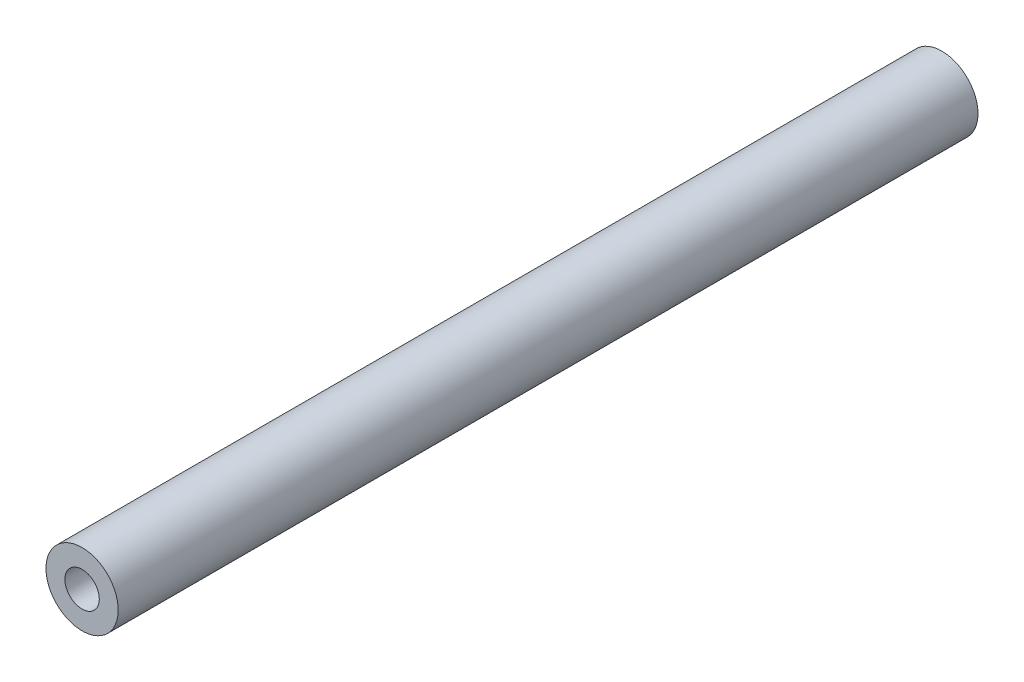
ISO-10303-21;
HEADER;
FILE_DESCRIPTION(('STEP AP214'),'2;1');
FILE_NAME('part.step','',(''),(''),'','','');
FILE_SCHEMA(('AUTOMOTIVE_DESIGN { 1 0 10303 214 1 1 1 1 }'));
ENDSEC;
DATA;
#1=APPLICATION_CONTEXT('core data for automotive mechanical design processes');
#2=APPLICATION_PROTOCOL_DEFINITION('international standard','automotive_design',2000,#1);
#3=PRODUCT_CONTEXT('',#1,'mechanical');
#4=PRODUCT('Part','Part','',(#3));
#5=PRODUCT_RELATED_PRODUCT_CATEGORY('part','',(#4));
#6=PRODUCT_DEFINITION_FORMATION('','',#4);
#7=PRODUCT_DEFINITION_CONTEXT('part definition',#1,'design');
#8=PRODUCT_DEFINITION('design','',#6,#7);
#9=PRODUCT_DEFINITION_SHAPE('','',#8);
#10=(LENGTH_UNIT() NAMED_UNIT(*) SI_UNIT(.MILLI.,.METRE.));
#11=(NAMED_UNIT(*) PLANE_ANGLE_UNIT() SI_UNIT($,.RADIAN.));
#12=(NAMED_UNIT(*) SI_UNIT($,.STERADIAN.) SOLID_ANGLE_UNIT());
#13=UNCERTAINTY_MEASURE_WITH_UNIT(LENGTH_MEASURE(1.E-05),#10,'distance_accuracy_value','');
#14=(GEOMETRIC_REPRESENTATION_CONTEXT(3) GLOBAL_UNCERTAINTY_ASSIGNED_CONTEXT((#13)) GLOBAL_UNIT_ASSIGNED_CONTEXT((#10,
#11,#12)) REPRESENTATION_CONTEXT('',''));
#15=CARTESIAN_POINT('',(0.,0.,0.));
#16=DIRECTION('',(0.,0.,1.));
#17=DIRECTION('',(1.,0.,0.));
#18=AXIS2_PLACEMENT_3D('',#15,#16,#17);
#19=CARTESIAN_POINT('',(0.,1.50000000000001,-37.5));
#20=DIRECTION('',(0.,0.,-1.));
#21=DIRECTION('',(0.,1.,0.));
#22=AXIS2_PLACEMENT_3D('',#19,#20,#21);
#23=PLANE('',#22);
#24=CARTESIAN_POINT('',(0.,0.,-37.5));
#25=DIRECTION('',(0.,0.,-1.));
#26=DIRECTION('',(0.,1.,0.));
#27=AXIS2_PLACEMENT_3D('',#24,#25,#26);
#28=CIRCLE('',#27,3.14999999999997);
#29=CARTESIAN_POINT('',(0.,3.15,-37.5));
#30=VERTEX_POINT('',#29);
#31=EDGE_CURVE('E10',#30,#30,#28,.T.);
#32=ORIENTED_EDGE('',*,*,#31,.T.);
#33=EDGE_LOOP('',(#32));
#34=FACE_BOUND('',#33,.T.);
#35=CARTESIAN_POINT('',(0.,0.,-37.5));
#36=DIRECTION('',(0.,0.,-1.));
#37=DIRECTION('',(0.,1.,0.));
#38=AXIS2_PLACEMENT_3D('',#35,#36,#37);
#39=CIRCLE('',#38,1.49999999999998);
#40=CARTESIAN_POINT('',(0.,1.50000000000001,-37.5));
#41=VERTEX_POINT('',#40);
#42=EDGE_CURVE('E53',#41,#41,#39,.T.);
#43=ORIENTED_EDGE('',*,*,#42,.F.);
#44=EDGE_LOOP('',(#43));
#45=FACE_BOUND('',#44,.T.);
#46=ADVANCED_FACE('F31',(#34,#45),#23,.T.);
#47=CARTESIAN_POINT('',(0.,0.,25.5));
#48=DIRECTION('',(0.,0.,-1.));
#49=DIRECTION('',(0.,1.,0.));
#50=AXIS2_PLACEMENT_3D('',#47,#48,#49);
#51=CYLINDRICAL_SURFACE('',#50,3.14999999999999);
#52=CARTESIAN_POINT('',(0.,0.,37.5));
#53=DIRECTION('',(0.,0.,-1.));
#54=DIRECTION('',(0.,1.,0.));
#55=AXIS2_PLACEMENT_3D('',#52,#53,#54);
#56=CIRCLE('',#55,3.15000000000001);
#57=CARTESIAN_POINT('',(0.,3.15,37.5));
#58=VERTEX_POINT('',#57);
#59=EDGE_CURVE('E37',#58,#58,#56,.T.);
#60=ORIENTED_EDGE('',*,*,#59,.T.);
#61=EDGE_LOOP('',(#60));
#62=FACE_BOUND('',#61,.T.);
#63=ORIENTED_EDGE('',*,*,#31,.F.);
#64=EDGE_LOOP('',(#63));
#65=FACE_BOUND('',#64,.T.);
#66=ADVANCED_FACE('F61',(#62,#65),#51,.T.);
#67=CARTESIAN_POINT('',(0.,3.15,37.5));
#68=DIRECTION('',(0.,0.,1.));
#69=DIRECTION('',(0.,-1.,0.));
#70=AXIS2_PLACEMENT_3D('',#67,#68,#69);
#71=PLANE('',#70);
#72=CARTESIAN_POINT('',(0.,0.,37.5));
#73=DIRECTION('',(0.,0.,-1.));
#74=DIRECTION('',(0.,1.,0.));
#75=AXIS2_PLACEMENT_3D('',#72,#73,#74);
#76=CIRCLE('',#75,1.50000000000001);
#77=CARTESIAN_POINT('',(0.,1.5,37.5));
#78=VERTEX_POINT('',#77);
#79=EDGE_CURVE('E41',#78,#78,#76,.T.);
#80=ORIENTED_EDGE('',*,*,#79,.T.);
#81=EDGE_LOOP('',(#80));
#82=FACE_BOUND('',#81,.T.);
#83=ORIENTED_EDGE('',*,*,#59,.F.);
#84=EDGE_LOOP('',(#83));
#85=FACE_BOUND('',#84,.T.);
#86=ADVANCED_FACE('F65',(#82,#85),#71,.T.);
#87=CARTESIAN_POINT('',(0.,0.,25.5));
#88=DIRECTION('',(0.,0.,-1.));
#89=DIRECTION('',(0.,1.,0.));
#90=AXIS2_PLACEMENT_3D('',#87,#88,#89);
#91=CYLINDRICAL_SURFACE('',#90,1.50000000000001);
#92=CARTESIAN_POINT('',(0.,0.,25.5));
#93=DIRECTION('',(0.,0.,-1.));
#94=DIRECTION('',(0.,1.,0.));
#95=AXIS2_PLACEMENT_3D('',#92,#93,#94);
#96=CIRCLE('',#95,1.5);
#97=CARTESIAN_POINT('',(0.,1.5,25.5));
#98=VERTEX_POINT('',#97);
#99=EDGE_CURVE('E45',#98,#98,#96,.T.);
#100=ORIENTED_EDGE('',*,*,#99,.T.);
#101=EDGE_LOOP('',(#100));
#102=FACE_BOUND('',#101,.T.);
#103=ORIENTED_EDGE('',*,*,#79,.F.);
#104=EDGE_LOOP('',(#103));
#105=FACE_BOUND('',#104,.T.);
#106=ADVANCED_FACE('F69',(#102,#105),#91,.F.);
#107=CARTESIAN_POINT('',(0.,1.5,25.5));
#108=DIRECTION('',(0.,0.,1.));
#109=DIRECTION('',(0.,-1.,0.));
#110=AXIS2_PLACEMENT_3D('',#107,#108,#109);
#111=PLANE('',#110);
#112=ORIENTED_EDGE('',*,*,#99,.F.);
#113=EDGE_LOOP('',(#112));
#114=FACE_BOUND('',#113,.T.);
#115=ADVANCED_FACE('F76',(#114),#111,.T.);
#116=CARTESIAN_POINT('',(0.,0.,-25.5));
#117=DIRECTION('',(0.,0.,-1.));
#118=DIRECTION('',(0.,1.,0.));
#119=AXIS2_PLACEMENT_3D('',#116,#117,#118);
#120=PLANE('',#119);
#121=CARTESIAN_POINT('',(0.,0.,-25.5));
#122=DIRECTION('',(0.,0.,-1.));
#123=DIRECTION('',(0.,1.,0.));
#124=AXIS2_PLACEMENT_3D('',#121,#122,#123);
#125=CIRCLE('',#124,1.49999999999998);
#126=CARTESIAN_POINT('',(0.,1.50000000000001,-25.5));
#127=VERTEX_POINT('',#126);
#128=EDGE_CURVE('E50',#127,#127,#125,.T.);
#129=ORIENTED_EDGE('',*,*,#128,.T.);
#130=EDGE_LOOP('',(#129));
#131=FACE_BOUND('',#130,.T.);
#132=ADVANCED_FACE('F80',(#131),#120,.T.);
#133=CARTESIAN_POINT('',(0.,0.,25.5));
#134=DIRECTION('',(0.,0.,-1.));
#135=DIRECTION('',(0.,1.,0.));
#136=AXIS2_PLACEMENT_3D('',#133,#134,#135);
#137=CYLINDRICAL_SURFACE('',#136,1.49999999999998);
#138=ORIENTED_EDGE('',*,*,#42,.T.);
#139=EDGE_LOOP('',(#138));
#140=FACE_BOUND('',#139,.T.);
#141=ORIENTED_EDGE('',*,*,#128,.F.);
#142=EDGE_LOOP('',(#141));
#143=FACE_BOUND('',#142,.T.);
#144=ADVANCED_FACE('F57',(#140,#143),#137,.F.);
#145=CLOSED_SHELL('',(#46,#66,#86,#106,#115,#132,#144));
#146=MANIFOLD_SOLID_BREP('B2',#145);
#147=ADVANCED_BREP_SHAPE_REPRESENTATION('',(#18,#146),#14);
#148=SHAPE_DEFINITION_REPRESENTATION(#9,#147);
ENDSEC;
END-ISO-10303-21;
